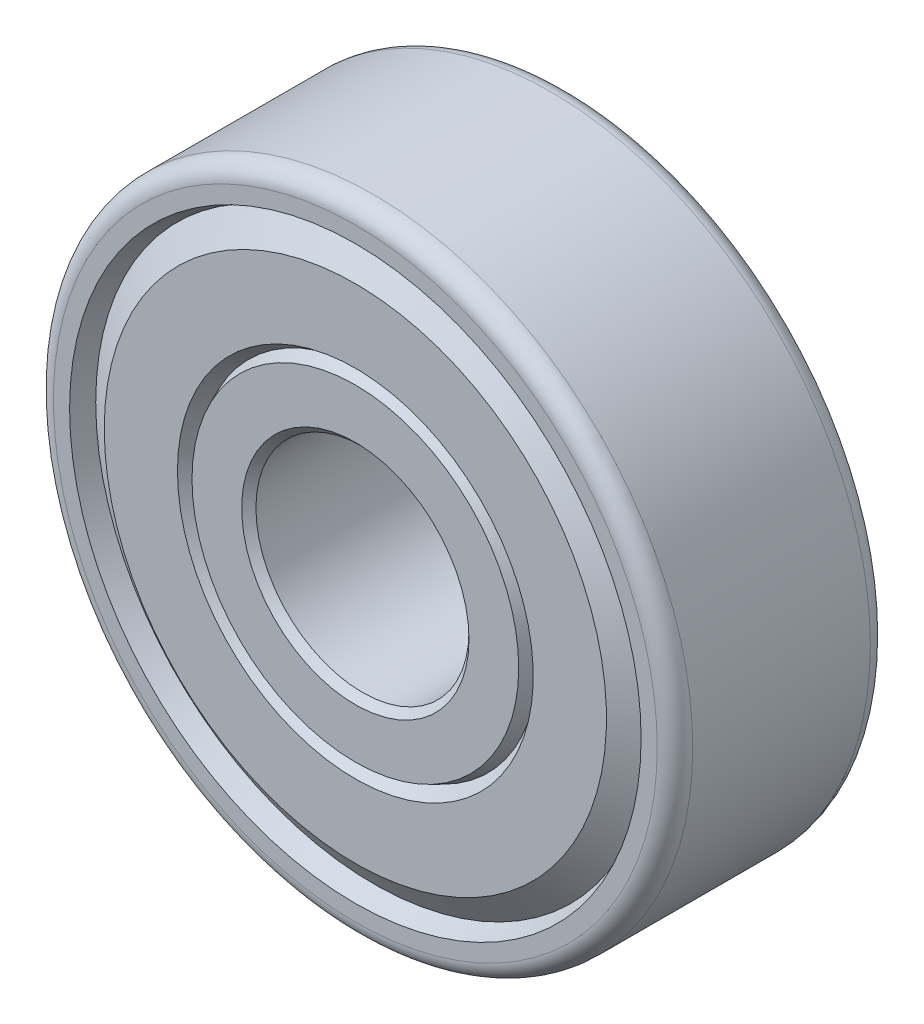
ISO-10303-21;
HEADER;
FILE_DESCRIPTION(('STEP AP214'),'2;1');
FILE_NAME('part.step','',(''),(''),'','','');
FILE_SCHEMA(('AUTOMOTIVE_DESIGN { 1 0 10303 214 1 1 1 1 }'));
ENDSEC;
DATA;
#1=APPLICATION_CONTEXT('core data for automotive mechanical design processes');
#2=APPLICATION_PROTOCOL_DEFINITION('international standard','automotive_design',2000,#1);
#3=PRODUCT_CONTEXT('',#1,'mechanical');
#4=PRODUCT('Part','Part','',(#3));
#5=PRODUCT_RELATED_PRODUCT_CATEGORY('part','',(#4));
#6=PRODUCT_DEFINITION_FORMATION('','',#4);
#7=PRODUCT_DEFINITION_CONTEXT('part definition',#1,'design');
#8=PRODUCT_DEFINITION('design','',#6,#7);
#9=PRODUCT_DEFINITION_SHAPE('','',#8);
#10=(LENGTH_UNIT() NAMED_UNIT(*) SI_UNIT(.MILLI.,.METRE.));
#11=(NAMED_UNIT(*) PLANE_ANGLE_UNIT() SI_UNIT($,.RADIAN.));
#12=(NAMED_UNIT(*) SI_UNIT($,.STERADIAN.) SOLID_ANGLE_UNIT());
#13=UNCERTAINTY_MEASURE_WITH_UNIT(LENGTH_MEASURE(1.E-05),#10,'distance_accuracy_value','');
#14=(GEOMETRIC_REPRESENTATION_CONTEXT(3) GLOBAL_UNCERTAINTY_ASSIGNED_CONTEXT((#13)) GLOBAL_UNIT_ASSIGNED_CONTEXT((#10,
#11,#12)) REPRESENTATION_CONTEXT('',''));
#15=CARTESIAN_POINT('',(0.,0.,0.));
#16=DIRECTION('',(0.,0.,1.));
#17=DIRECTION('',(1.,0.,0.));
#18=AXIS2_PLACEMENT_3D('',#15,#16,#17);
#19=CARTESIAN_POINT('',(0.,0.,-4.60374999999999));
#20=DIRECTION('',(0.,0.,-1.));
#21=DIRECTION('',(-1.,0.,0.));
#22=AXIS2_PLACEMENT_3D('',#19,#20,#21);
#23=CONICAL_SURFACE('',#22,4.92125,0.7853981625);
#24=CARTESIAN_POINT('',(0.,0.,-4.445));
#25=DIRECTION('',(0.,0.,1.));
#26=DIRECTION('',(-1.,0.,0.));
#27=AXIS2_PLACEMENT_3D('',#24,#25,#26);
#28=CIRCLE('',#27,4.7625);
#29=CARTESIAN_POINT('',(4.7625,0.,-4.445));
#30=VERTEX_POINT('',#29);
#31=EDGE_CURVE('E9',#30,#30,#28,.T.);
#32=ORIENTED_EDGE('',*,*,#31,.T.);
#33=EDGE_LOOP('',(#32));
#34=FACE_BOUND('',#33,.T.);
#35=CARTESIAN_POINT('',(0.,0.,-4.7625));
#36=DIRECTION('',(0.,0.,-1.));
#37=DIRECTION('',(-1.,0.,0.));
#38=AXIS2_PLACEMENT_3D('',#35,#36,#37);
#39=CIRCLE('',#38,5.08);
#40=CARTESIAN_POINT('',(5.07999999999997,0.,-4.7625));
#41=VERTEX_POINT('',#40);
#42=EDGE_CURVE('E25',#41,#41,#39,.T.);
#43=ORIENTED_EDGE('',*,*,#42,.T.);
#44=EDGE_LOOP('',(#43));
#45=FACE_BOUND('',#44,.T.);
#46=ADVANCED_FACE('F14',(#34,#45),#23,.F.);
#47=CARTESIAN_POINT('',(0.,0.,0.));
#48=DIRECTION('',(0.,0.,1.));
#49=DIRECTION('',(-1.,0.,0.));
#50=AXIS2_PLACEMENT_3D('',#47,#48,#49);
#51=CYLINDRICAL_SURFACE('',#50,4.7625);
#52=CARTESIAN_POINT('',(0.,0.,4.445));
#53=DIRECTION('',(0.,0.,-1.));
#54=DIRECTION('',(-1.,0.,0.));
#55=AXIS2_PLACEMENT_3D('',#52,#53,#54);
#56=CIRCLE('',#55,4.7625);
#57=CARTESIAN_POINT('',(4.7625,0.,4.445));
#58=VERTEX_POINT('',#57);
#59=EDGE_CURVE('E143',#58,#58,#56,.T.);
#60=ORIENTED_EDGE('',*,*,#59,.F.);
#61=EDGE_LOOP('',(#60));
#62=FACE_BOUND('',#61,.T.);
#63=ORIENTED_EDGE('',*,*,#31,.F.);
#64=EDGE_LOOP('',(#63));
#65=FACE_BOUND('',#64,.T.);
#66=ADVANCED_FACE('F216',(#62,#65),#51,.F.);
#67=CARTESIAN_POINT('',(0.,0.,-4.7625));
#68=DIRECTION('',(0.,0.,-1.));
#69=DIRECTION('',(0.,-1.,0.));
#70=AXIS2_PLACEMENT_3D('',#67,#68,#69);
#71=PLANE('',#70);
#72=CARTESIAN_POINT('',(0.,0.,-4.7625));
#73=DIRECTION('',(0.,0.,-1.));
#74=DIRECTION('',(-1.,0.,0.));
#75=AXIS2_PLACEMENT_3D('',#72,#73,#74);
#76=CIRCLE('',#75,7.3025);
#77=CARTESIAN_POINT('',(-7.30249999999999,0.,-4.7625));
#78=VERTEX_POINT('',#77);
#79=EDGE_CURVE('E147',#78,#78,#76,.T.);
#80=ORIENTED_EDGE('',*,*,#79,.T.);
#81=EDGE_LOOP('',(#80));
#82=FACE_BOUND('',#81,.T.);
#83=ORIENTED_EDGE('',*,*,#42,.F.);
#84=EDGE_LOOP('',(#83));
#85=FACE_BOUND('',#84,.T.);
#86=ADVANCED_FACE('F222',(#82,#85),#71,.T.);
#87=CARTESIAN_POINT('',(0.,0.,4.60375000000002));
#88=DIRECTION('',(0.,0.,1.));
#89=DIRECTION('',(-1.,0.,0.));
#90=AXIS2_PLACEMENT_3D('',#87,#88,#89);
#91=CONICAL_SURFACE('',#90,4.92125,0.7853981625);
#92=ORIENTED_EDGE('',*,*,#59,.T.);
#93=EDGE_LOOP('',(#92));
#94=FACE_BOUND('',#93,.T.);
#95=CARTESIAN_POINT('',(0.,0.,4.7625));
#96=DIRECTION('',(0.,0.,1.));
#97=DIRECTION('',(-1.,0.,0.));
#98=AXIS2_PLACEMENT_3D('',#95,#96,#97);
#99=CIRCLE('',#98,5.08);
#100=CARTESIAN_POINT('',(5.07999999999997,0.,4.7625));
#101=VERTEX_POINT('',#100);
#102=EDGE_CURVE('E50',#101,#101,#99,.T.);
#103=ORIENTED_EDGE('',*,*,#102,.T.);
#104=EDGE_LOOP('',(#103));
#105=FACE_BOUND('',#104,.T.);
#106=ADVANCED_FACE('F211',(#94,#105),#91,.F.);
#107=CARTESIAN_POINT('',(0.,0.,4.7625));
#108=DIRECTION('',(0.,0.,-1.));
#109=DIRECTION('',(0.,-1.,0.));
#110=AXIS2_PLACEMENT_3D('',#107,#108,#109);
#111=PLANE('',#110);
#112=CARTESIAN_POINT('',(0.,0.,4.7625));
#113=DIRECTION('',(0.,0.,1.));
#114=DIRECTION('',(-1.,0.,0.));
#115=AXIS2_PLACEMENT_3D('',#112,#113,#114);
#116=CIRCLE('',#115,7.3025);
#117=CARTESIAN_POINT('',(-7.30249999999999,0.,4.7625));
#118=VERTEX_POINT('',#117);
#119=EDGE_CURVE('E18',#118,#118,#116,.T.);
#120=ORIENTED_EDGE('',*,*,#119,.T.);
#121=EDGE_LOOP('',(#120));
#122=FACE_BOUND('',#121,.T.);
#123=ORIENTED_EDGE('',*,*,#102,.F.);
#124=EDGE_LOOP('',(#123));
#125=FACE_BOUND('',#124,.T.);
#126=ADVANCED_FACE('F204',(#122,#125),#111,.F.);
#127=CARTESIAN_POINT('',(0.,0.,-3.96874999999999));
#128=DIRECTION('',(0.,0.,1.));
#129=DIRECTION('',(1.,0.,0.));
#130=AXIS2_PLACEMENT_3D('',#127,#128,#129);
#131=TOROIDAL_SURFACE('',#130,13.49375,0.79375);
#132=CARTESIAN_POINT('',(0.,0.,-4.7625));
#133=DIRECTION('',(0.,0.,1.));
#134=DIRECTION('',(-1.,0.,0.));
#135=AXIS2_PLACEMENT_3D('',#132,#133,#134);
#136=CIRCLE('',#135,13.49375);
#137=CARTESIAN_POINT('',(13.49375,0.,-4.7625));
#138=VERTEX_POINT('',#137);
#139=EDGE_CURVE('E68',#138,#138,#136,.T.);
#140=ORIENTED_EDGE('',*,*,#139,.T.);
#141=EDGE_LOOP('',(#140));
#142=FACE_BOUND('',#141,.T.);
#143=CARTESIAN_POINT('',(0.,0.,-3.96874999999999));
#144=DIRECTION('',(0.,0.,-1.));
#145=DIRECTION('',(-1.,0.,0.));
#146=AXIS2_PLACEMENT_3D('',#143,#144,#145);
#147=CIRCLE('',#146,14.2875);
#148=CARTESIAN_POINT('',(14.2875,0.,-3.96874999999999));
#149=VERTEX_POINT('',#148);
#150=EDGE_CURVE('E153',#149,#149,#147,.T.);
#151=ORIENTED_EDGE('',*,*,#150,.T.);
#152=EDGE_LOOP('',(#151));
#153=FACE_BOUND('',#152,.T.);
#154=ADVANCED_FACE('F200',(#142,#153),#131,.T.);
#155=CARTESIAN_POINT('',(0.,0.,0.));
#156=DIRECTION('',(0.,0.,1.));
#157=DIRECTION('',(-1.,0.,0.));
#158=AXIS2_PLACEMENT_3D('',#155,#156,#157);
#159=CYLINDRICAL_SURFACE('',#158,14.2875);
#160=CARTESIAN_POINT('',(0.,0.,3.96875000000002));
#161=DIRECTION('',(0.,0.,1.));
#162=DIRECTION('',(-1.,0.,0.));
#163=AXIS2_PLACEMENT_3D('',#160,#161,#162);
#164=CIRCLE('',#163,14.2875);
#165=CARTESIAN_POINT('',(14.2875,0.,3.96874999999999));
#166=VERTEX_POINT('',#165);
#167=EDGE_CURVE('E152',#166,#166,#164,.T.);
#168=ORIENTED_EDGE('',*,*,#167,.F.);
#169=EDGE_LOOP('',(#168));
#170=FACE_BOUND('',#169,.T.);
#171=ORIENTED_EDGE('',*,*,#150,.F.);
#172=EDGE_LOOP('',(#171));
#173=FACE_BOUND('',#172,.T.);
#174=ADVANCED_FACE('F196',(#170,#173),#159,.T.);
#175=CARTESIAN_POINT('',(0.,0.,-4.7625));
#176=DIRECTION('',(0.,0.,-1.));
#177=DIRECTION('',(0.,-1.,0.));
#178=AXIS2_PLACEMENT_3D('',#175,#176,#177);
#179=PLANE('',#178);
#180=ORIENTED_EDGE('',*,*,#139,.F.);
#181=EDGE_LOOP('',(#180));
#182=FACE_BOUND('',#181,.T.);
#183=CARTESIAN_POINT('',(0.,0.,-4.7625));
#184=DIRECTION('',(0.,0.,1.));
#185=DIRECTION('',(-1.,0.,0.));
#186=AXIS2_PLACEMENT_3D('',#183,#184,#185);
#187=CIRCLE('',#186,12.77293681286);
#188=CARTESIAN_POINT('',(-12.77293681286,0.,-4.7625));
#189=VERTEX_POINT('',#188);
#190=EDGE_CURVE('E157',#189,#189,#187,.T.);
#191=ORIENTED_EDGE('',*,*,#190,.T.);
#192=EDGE_LOOP('',(#191));
#193=FACE_BOUND('',#192,.T.);
#194=ADVANCED_FACE('F199',(#182,#193),#179,.T.);
#195=CARTESIAN_POINT('',(0.,0.,3.96875000000002));
#196=DIRECTION('',(0.,0.,-1.));
#197=DIRECTION('',(-1.,0.,0.));
#198=AXIS2_PLACEMENT_3D('',#195,#196,#197);
#199=TOROIDAL_SURFACE('',#198,13.49375,0.79375);
#200=CARTESIAN_POINT('',(0.,0.,4.7625));
#201=DIRECTION('',(0.,0.,-1.));
#202=DIRECTION('',(-1.,0.,0.));
#203=AXIS2_PLACEMENT_3D('',#200,#201,#202);
#204=CIRCLE('',#203,13.49375);
#205=CARTESIAN_POINT('',(13.49375,0.,4.7625));
#206=VERTEX_POINT('',#205);
#207=EDGE_CURVE('E161',#206,#206,#204,.T.);
#208=ORIENTED_EDGE('',*,*,#207,.T.);
#209=EDGE_LOOP('',(#208));
#210=FACE_BOUND('',#209,.T.);
#211=ORIENTED_EDGE('',*,*,#167,.T.);
#212=EDGE_LOOP('',(#211));
#213=FACE_BOUND('',#212,.T.);
#214=ADVANCED_FACE('F194',(#210,#213),#199,.T.);
#215=CARTESIAN_POINT('',(0.,0.,4.7625));
#216=DIRECTION('',(0.,0.,-1.));
#217=DIRECTION('',(0.,-1.,0.));
#218=AXIS2_PLACEMENT_3D('',#215,#216,#217);
#219=PLANE('',#218);
#220=ORIENTED_EDGE('',*,*,#207,.F.);
#221=EDGE_LOOP('',(#220));
#222=FACE_BOUND('',#221,.T.);
#223=CARTESIAN_POINT('',(0.,0.,4.7625));
#224=DIRECTION('',(0.,0.,-1.));
#225=DIRECTION('',(-1.,0.,0.));
#226=AXIS2_PLACEMENT_3D('',#223,#224,#225);
#227=CIRCLE('',#226,12.77293681286);
#228=CARTESIAN_POINT('',(-12.77293681286,0.,4.7625));
#229=VERTEX_POINT('',#228);
#230=EDGE_CURVE('E148',#229,#229,#227,.T.);
#231=ORIENTED_EDGE('',*,*,#230,.T.);
#232=EDGE_LOOP('',(#231));
#233=FACE_BOUND('',#232,.T.);
#234=ADVANCED_FACE('F256',(#222,#233),#219,.F.);
#235=CARTESIAN_POINT('',(0.,0.,-4.7625));
#236=DIRECTION('',(0.,0.,1.));
#237=DIRECTION('',(1.,0.,0.));
#238=AXIS2_PLACEMENT_3D('',#235,#236,#237);
#239=CONICAL_SURFACE('',#238,11.2241326943492,0.969766785990084);
#240=CARTESIAN_POINT('',(0.,0.,-3.93017144225871));
#241=DIRECTION('',(0.,0.,1.));
#242=DIRECTION('',(-1.,0.,0.));
#243=AXIS2_PLACEMENT_3D('',#240,#241,#242);
#244=CIRCLE('',#243,12.4380602466955);
#245=CARTESIAN_POINT('',(-12.4380602466955,0.,-3.93017144225874));
#246=VERTEX_POINT('',#245);
#247=EDGE_CURVE('E98',#246,#246,#244,.T.);
#248=ORIENTED_EDGE('',*,*,#247,.F.);
#249=EDGE_LOOP('',(#248));
#250=FACE_BOUND('',#249,.T.);
#251=CARTESIAN_POINT('',(0.,0.,-4.7625));
#252=DIRECTION('',(0.,0.,-1.));
#253=DIRECTION('',(-1.,0.,0.));
#254=AXIS2_PLACEMENT_3D('',#251,#252,#253);
#255=CIRCLE('',#254,11.2241326943492);
#256=CARTESIAN_POINT('',(-11.2241326943492,0.,-4.7625));
#257=VERTEX_POINT('',#256);
#258=EDGE_CURVE('E109',#257,#257,#255,.T.);
#259=ORIENTED_EDGE('',*,*,#258,.F.);
#260=EDGE_LOOP('',(#259));
#261=FACE_BOUND('',#260,.T.);
#262=ADVANCED_FACE('F250',(#250,#261),#239,.T.);
#263=CARTESIAN_POINT('',(0.,0.,-3.93017144225871));
#264=DIRECTION('',(0.,0.,-1.));
#265=DIRECTION('',(-1.,0.,0.));
#266=AXIS2_PLACEMENT_3D('',#263,#264,#265);
#267=CONICAL_SURFACE('',#266,12.4380602466955,0.382519398268517);
#268=ORIENTED_EDGE('',*,*,#190,.F.);
#269=EDGE_LOOP('',(#268));
#270=FACE_BOUND('',#269,.T.);
#271=ORIENTED_EDGE('',*,*,#247,.T.);
#272=EDGE_LOOP('',(#271));
#273=FACE_BOUND('',#272,.T.);
#274=ADVANCED_FACE('F242',(#270,#273),#267,.F.);
#275=CARTESIAN_POINT('',(0.,0.,-4.7625));
#276=DIRECTION('',(0.,0.,1.));
#277=DIRECTION('',(1.,0.,0.));
#278=AXIS2_PLACEMENT_3D('',#275,#276,#277);
#279=CONICAL_SURFACE('',#278,7.3025,0.407917424824535);
#280=CARTESIAN_POINT('',(0.,0.,-4.18132890087755));
#281=DIRECTION('',(0.,0.,1.));
#282=DIRECTION('',(-1.,0.,0.));
#283=AXIS2_PLACEMENT_3D('',#280,#281,#282);
#284=CIRCLE('',#283,7.55365742462337);
#285=CARTESIAN_POINT('',(-7.55365742462338,0.,-4.18132890087755));
#286=VERTEX_POINT('',#285);
#287=EDGE_CURVE('E170',#286,#286,#284,.T.);
#288=ORIENTED_EDGE('',*,*,#287,.F.);
#289=EDGE_LOOP('',(#288));
#290=FACE_BOUND('',#289,.T.);
#291=ORIENTED_EDGE('',*,*,#79,.F.);
#292=EDGE_LOOP('',(#291));
#293=FACE_BOUND('',#292,.T.);
#294=ADVANCED_FACE('F240',(#290,#293),#279,.T.);
#295=CARTESIAN_POINT('',(0.,0.,-4.18132890087755));
#296=DIRECTION('',(0.,0.,-1.));
#297=DIRECTION('',(-1.,0.,0.));
#298=AXIS2_PLACEMENT_3D('',#295,#296,#297);
#299=CONICAL_SURFACE('',#298,7.55365742462337,0.601029540804805);
#300=CARTESIAN_POINT('',(0.,0.,-4.7625));
#301=DIRECTION('',(0.,0.,1.));
#302=DIRECTION('',(-1.,0.,0.));
#303=AXIS2_PLACEMENT_3D('',#300,#301,#302);
#304=CIRCLE('',#303,7.952136972928);
#305=CARTESIAN_POINT('',(-7.95213697292801,0.,-4.7625));
#306=VERTEX_POINT('',#305);
#307=EDGE_CURVE('E174',#306,#306,#304,.T.);
#308=ORIENTED_EDGE('',*,*,#307,.F.);
#309=EDGE_LOOP('',(#308));
#310=FACE_BOUND('',#309,.T.);
#311=ORIENTED_EDGE('',*,*,#287,.T.);
#312=EDGE_LOOP('',(#311));
#313=FACE_BOUND('',#312,.T.);
#314=ADVANCED_FACE('F16',(#310,#313),#299,.F.);
#315=CARTESIAN_POINT('',(0.,0.,-4.7625));
#316=DIRECTION('',(0.,0.,-1.));
#317=DIRECTION('',(0.,-1.,0.));
#318=AXIS2_PLACEMENT_3D('',#315,#316,#317);
#319=PLANE('',#318);
#320=ORIENTED_EDGE('',*,*,#258,.T.);
#321=EDGE_LOOP('',(#320));
#322=FACE_BOUND('',#321,.T.);
#323=ORIENTED_EDGE('',*,*,#307,.T.);
#324=EDGE_LOOP('',(#323));
#325=FACE_BOUND('',#324,.T.);
#326=ADVANCED_FACE('F248',(#322,#325),#319,.T.);
#327=CARTESIAN_POINT('',(0.,0.,4.34633572112936));
#328=DIRECTION('',(0.,0.,-1.));
#329=DIRECTION('',(-1.,0.,0.));
#330=AXIS2_PLACEMENT_3D('',#327,#328,#329);
#331=CONICAL_SURFACE('',#330,11.8310964705223,0.969766784881962);
#332=CARTESIAN_POINT('',(0.,0.,3.93017144225871));
#333=DIRECTION('',(0.,0.,1.));
#334=DIRECTION('',(-1.,0.,0.));
#335=AXIS2_PLACEMENT_3D('',#332,#333,#334);
#336=CIRCLE('',#335,12.4380602466955);
#337=CARTESIAN_POINT('',(-12.4380602466955,0.,3.93017144225871));
#338=VERTEX_POINT('',#337);
#339=EDGE_CURVE('E178',#338,#338,#336,.T.);
#340=ORIENTED_EDGE('',*,*,#339,.T.);
#341=EDGE_LOOP('',(#340));
#342=FACE_BOUND('',#341,.T.);
#343=CARTESIAN_POINT('',(0.,0.,4.7625));
#344=DIRECTION('',(0.,0.,1.));
#345=DIRECTION('',(-1.,0.,0.));
#346=AXIS2_PLACEMENT_3D('',#343,#344,#345);
#347=CIRCLE('',#346,11.2241326943492);
#348=CARTESIAN_POINT('',(-11.2241326943492,0.,4.7625));
#349=VERTEX_POINT('',#348);
#350=EDGE_CURVE('E131',#349,#349,#347,.T.);
#351=ORIENTED_EDGE('',*,*,#350,.F.);
#352=EDGE_LOOP('',(#351));
#353=FACE_BOUND('',#352,.T.);
#354=ADVANCED_FACE('F259',(#342,#353),#331,.T.);
#355=CARTESIAN_POINT('',(0.,0.,4.34633572112936));
#356=DIRECTION('',(0.,0.,1.));
#357=DIRECTION('',(-1.,0.,0.));
#358=AXIS2_PLACEMENT_3D('',#355,#356,#357);
#359=CONICAL_SURFACE('',#358,12.6054985297777,0.382519397831444);
#360=ORIENTED_EDGE('',*,*,#230,.F.);
#361=EDGE_LOOP('',(#360));
#362=FACE_BOUND('',#361,.T.);
#363=ORIENTED_EDGE('',*,*,#339,.F.);
#364=EDGE_LOOP('',(#363));
#365=FACE_BOUND('',#364,.T.);
#366=ADVANCED_FACE('F230',(#362,#365),#359,.F.);
#367=CARTESIAN_POINT('',(0.,0.,4.47191445043876));
#368=DIRECTION('',(0.,0.,-1.));
#369=DIRECTION('',(-1.,0.,0.));
#370=AXIS2_PLACEMENT_3D('',#367,#368,#369);
#371=CONICAL_SURFACE('',#370,7.4280787123117,0.407917424358415);
#372=CARTESIAN_POINT('',(0.,0.,4.18132890087755));
#373=DIRECTION('',(0.,0.,1.));
#374=DIRECTION('',(-1.,0.,0.));
#375=AXIS2_PLACEMENT_3D('',#372,#373,#374);
#376=CIRCLE('',#375,7.55365742462337);
#377=CARTESIAN_POINT('',(-7.55365742462338,0.,4.18132890087752));
#378=VERTEX_POINT('',#377);
#379=EDGE_CURVE('E138',#378,#378,#376,.T.);
#380=ORIENTED_EDGE('',*,*,#379,.T.);
#381=EDGE_LOOP('',(#380));
#382=FACE_BOUND('',#381,.T.);
#383=ORIENTED_EDGE('',*,*,#119,.F.);
#384=EDGE_LOOP('',(#383));
#385=FACE_BOUND('',#384,.T.);
#386=ADVANCED_FACE('F227',(#382,#385),#371,.T.);
#387=CARTESIAN_POINT('',(0.,0.,4.47191445043876));
#388=DIRECTION('',(0.,0.,1.));
#389=DIRECTION('',(-1.,0.,0.));
#390=AXIS2_PLACEMENT_3D('',#387,#388,#389);
#391=CONICAL_SURFACE('',#390,7.75289719877568,0.601029540118034);
#392=CARTESIAN_POINT('',(0.,0.,4.7625));
#393=DIRECTION('',(0.,0.,-1.));
#394=DIRECTION('',(-1.,0.,0.));
#395=AXIS2_PLACEMENT_3D('',#392,#393,#394);
#396=CIRCLE('',#395,7.952136972928);
#397=CARTESIAN_POINT('',(-7.95213697292801,0.,4.7625));
#398=VERTEX_POINT('',#397);
#399=EDGE_CURVE('E126',#398,#398,#396,.T.);
#400=ORIENTED_EDGE('',*,*,#399,.F.);
#401=EDGE_LOOP('',(#400));
#402=FACE_BOUND('',#401,.T.);
#403=ORIENTED_EDGE('',*,*,#379,.F.);
#404=EDGE_LOOP('',(#403));
#405=FACE_BOUND('',#404,.T.);
#406=ADVANCED_FACE('F127',(#402,#405),#391,.F.);
#407=CARTESIAN_POINT('',(0.,0.,4.7625));
#408=DIRECTION('',(0.,0.,-1.));
#409=DIRECTION('',(0.,-1.,0.));
#410=AXIS2_PLACEMENT_3D('',#407,#408,#409);
#411=PLANE('',#410);
#412=ORIENTED_EDGE('',*,*,#350,.T.);
#413=EDGE_LOOP('',(#412));
#414=FACE_BOUND('',#413,.T.);
#415=ORIENTED_EDGE('',*,*,#399,.T.);
#416=EDGE_LOOP('',(#415));
#417=FACE_BOUND('',#416,.T.);
#418=ADVANCED_FACE('F264',(#414,#417),#411,.F.);
#419=CLOSED_SHELL('',(#46,#66,#86,#106,#126,#154,#174,#194,#214,#234,#262,#274,#294,#314,#326,
#354,#366,#386,#406,#418));
#420=MANIFOLD_SOLID_BREP('B1',#419);
#421=ADVANCED_BREP_SHAPE_REPRESENTATION('',(#18,#420),#14);
#422=SHAPE_DEFINITION_REPRESENTATION(#9,#421);
ENDSEC;
END-ISO-10303-21;
